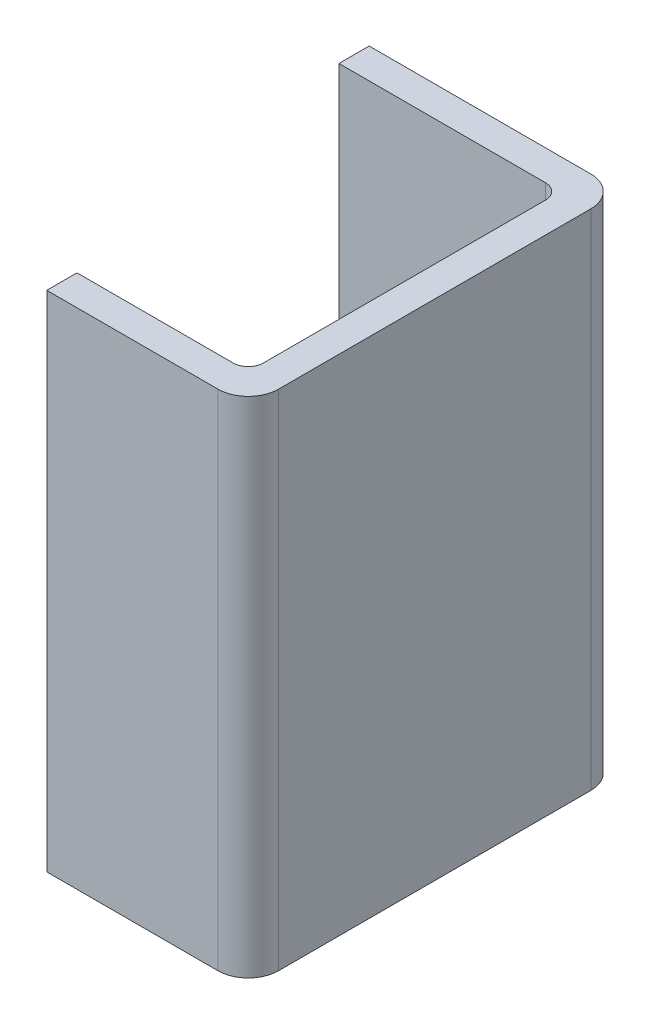
ISO-10303-21;
HEADER;
FILE_DESCRIPTION(('STEP AP214'),'2;1');
FILE_NAME('part.step','',(''),(''),'','','');
FILE_SCHEMA(('AUTOMOTIVE_DESIGN { 1 0 10303 214 1 1 1 1 }'));
ENDSEC;
DATA;
#1=APPLICATION_CONTEXT('core data for automotive mechanical design processes');
#2=APPLICATION_PROTOCOL_DEFINITION('international standard','automotive_design',2000,#1);
#3=PRODUCT_CONTEXT('',#1,'mechanical');
#4=PRODUCT('Part','Part','',(#3));
#5=PRODUCT_RELATED_PRODUCT_CATEGORY('part','',(#4));
#6=PRODUCT_DEFINITION_FORMATION('','',#4);
#7=PRODUCT_DEFINITION_CONTEXT('part definition',#1,'design');
#8=PRODUCT_DEFINITION('design','',#6,#7);
#9=PRODUCT_DEFINITION_SHAPE('','',#8);
#10=(LENGTH_UNIT() NAMED_UNIT(*) SI_UNIT(.MILLI.,.METRE.));
#11=(NAMED_UNIT(*) PLANE_ANGLE_UNIT() SI_UNIT($,.RADIAN.));
#12=(NAMED_UNIT(*) SI_UNIT($,.STERADIAN.) SOLID_ANGLE_UNIT());
#13=UNCERTAINTY_MEASURE_WITH_UNIT(LENGTH_MEASURE(1.E-05),#10,'distance_accuracy_value','');
#14=(GEOMETRIC_REPRESENTATION_CONTEXT(3) GLOBAL_UNCERTAINTY_ASSIGNED_CONTEXT((#13)) GLOBAL_UNIT_ASSIGNED_CONTEXT((#10,
#11,#12)) REPRESENTATION_CONTEXT('',''));
#15=CARTESIAN_POINT('',(0.,0.,0.));
#16=DIRECTION('',(0.,0.,1.));
#17=DIRECTION('',(1.,0.,0.));
#18=AXIS2_PLACEMENT_3D('',#15,#16,#17);
#19=CARTESIAN_POINT('',(0.375,-0.25,0.185));
#20=DIRECTION('',(0.,1.,0.));
#21=DIRECTION('',(0.,0.,1.));
#22=AXIS2_PLACEMENT_3D('',#19,#20,#21);
#23=PLANE('',#22);
#24=CARTESIAN_POINT('',(0.455,-0.25,0.0449999999999999));
#25=DIRECTION('',(0.,1.,0.));
#26=DIRECTION('',(-1.,0.,0.));
#27=AXIS2_PLACEMENT_3D('',#24,#25,#26);
#28=CIRCLE('',#27,0.015);
#29=CARTESIAN_POINT('',(0.47,-0.25,0.0449999999999999));
#30=VERTEX_POINT('',#29);
#31=CARTESIAN_POINT('',(0.455,-0.25,0.0299999999999999));
#32=VERTEX_POINT('',#31);
#33=EDGE_CURVE('E11',#30,#32,#28,.T.);
#34=ORIENTED_EDGE('',*,*,#33,.T.);
#35=DIRECTION('',(-1.,0.,0.));
#36=VECTOR('',#35,1.);
#37=CARTESIAN_POINT('',(-0.455000000000001,-0.25,0.03));
#38=LINE('',#37,#36);
#39=CARTESIAN_POINT('',(0.25,-0.25,0.0299999999999999));
#40=VERTEX_POINT('',#39);
#41=EDGE_CURVE('E24',#32,#40,#38,.T.);
#42=ORIENTED_EDGE('',*,*,#41,.T.);
#43=DIRECTION('',(0.,0.,-1.));
#44=VECTOR('',#43,1.);
#45=CARTESIAN_POINT('',(0.25,-0.25,-0.03));
#46=LINE('',#45,#44);
#47=CARTESIAN_POINT('',(0.25,-0.25,0.));
#48=VERTEX_POINT('',#47);
#49=EDGE_CURVE('E197',#40,#48,#46,.T.);
#50=ORIENTED_EDGE('',*,*,#49,.T.);
#51=DIRECTION('',(1.,0.,0.));
#52=VECTOR('',#51,1.);
#53=CARTESIAN_POINT('',(0.47,-0.25,0.));
#54=LINE('',#53,#52);
#55=CARTESIAN_POINT('',(0.47,-0.25,0.));
#56=VERTEX_POINT('',#55);
#57=EDGE_CURVE('E195',#48,#56,#54,.T.);
#58=ORIENTED_EDGE('',*,*,#57,.T.);
#59=CARTESIAN_POINT('',(0.47,-0.25,0.03));
#60=DIRECTION('',(0.,-1.,0.));
#61=DIRECTION('',(1.,0.,0.));
#62=AXIS2_PLACEMENT_3D('',#59,#60,#61);
#63=CIRCLE('',#62,0.03);
#64=CARTESIAN_POINT('',(0.5,-0.25,0.03));
#65=VERTEX_POINT('',#64);
#66=EDGE_CURVE('E193',#56,#65,#63,.T.);
#67=ORIENTED_EDGE('',*,*,#66,.T.);
#68=DIRECTION('',(0.,0.,1.));
#69=VECTOR('',#68,1.);
#70=CARTESIAN_POINT('',(0.5,-0.25,0.34));
#71=LINE('',#70,#69);
#72=CARTESIAN_POINT('',(0.5,-0.25,0.34));
#73=VERTEX_POINT('',#72);
#74=EDGE_CURVE('E191',#65,#73,#71,.T.);
#75=ORIENTED_EDGE('',*,*,#74,.T.);
#76=CARTESIAN_POINT('',(0.47,-0.25,0.34));
#77=DIRECTION('',(0.,-1.,0.));
#78=DIRECTION('',(0.,0.,1.));
#79=AXIS2_PLACEMENT_3D('',#76,#77,#78);
#80=CIRCLE('',#79,0.03);
#81=CARTESIAN_POINT('',(0.47,-0.25,0.37));
#82=VERTEX_POINT('',#81);
#83=EDGE_CURVE('E189',#73,#82,#80,.T.);
#84=ORIENTED_EDGE('',*,*,#83,.T.);
#85=DIRECTION('',(-1.,0.,0.));
#86=VECTOR('',#85,1.);
#87=CARTESIAN_POINT('',(-0.47,-0.25,0.37));
#88=LINE('',#87,#86);
#89=CARTESIAN_POINT('',(0.3,-0.25,0.37));
#90=VERTEX_POINT('',#89);
#91=EDGE_CURVE('E187',#82,#90,#88,.T.);
#92=ORIENTED_EDGE('',*,*,#91,.T.);
#93=DIRECTION('',(0.,0.,-1.));
#94=VECTOR('',#93,1.);
#95=CARTESIAN_POINT('',(0.3,-0.25,0.194187828264924));
#96=LINE('',#95,#94);
#97=CARTESIAN_POINT('',(0.3,-0.25,0.34));
#98=VERTEX_POINT('',#97);
#99=EDGE_CURVE('E185',#90,#98,#96,.T.);
#100=ORIENTED_EDGE('',*,*,#99,.T.);
#101=DIRECTION('',(1.,0.,0.));
#102=VECTOR('',#101,1.);
#103=CARTESIAN_POINT('',(0.455,-0.25,0.34));
#104=LINE('',#103,#102);
#105=CARTESIAN_POINT('',(0.455,-0.25,0.34));
#106=VERTEX_POINT('',#105);
#107=EDGE_CURVE('E183',#98,#106,#104,.T.);
#108=ORIENTED_EDGE('',*,*,#107,.T.);
#109=CARTESIAN_POINT('',(0.455,-0.25,0.325));
#110=DIRECTION('',(0.,1.,0.));
#111=DIRECTION('',(0.,0.,-1.));
#112=AXIS2_PLACEMENT_3D('',#109,#110,#111);
#113=CIRCLE('',#112,0.015);
#114=CARTESIAN_POINT('',(0.47,-0.25,0.325));
#115=VERTEX_POINT('',#114);
#116=EDGE_CURVE('E181',#106,#115,#113,.T.);
#117=ORIENTED_EDGE('',*,*,#116,.T.);
#118=DIRECTION('',(0.,0.,-1.));
#119=VECTOR('',#118,1.);
#120=CARTESIAN_POINT('',(0.47,-0.25,0.0449999999999999));
#121=LINE('',#120,#119);
#122=EDGE_CURVE('E179',#115,#30,#121,.T.);
#123=ORIENTED_EDGE('',*,*,#122,.T.);
#124=EDGE_LOOP('',(#34,#42,#50,#58,#67,#75,#84,#92,#100,#108,#117,#123));
#125=FACE_BOUND('',#124,.T.);
#126=ADVANCED_FACE('F17',(#125),#23,.F.);
#127=CARTESIAN_POINT('',(0.25,0.,0.0299999999999999));
#128=DIRECTION('',(0.,0.,1.));
#129=DIRECTION('',(1.,0.,0.));
#130=AXIS2_PLACEMENT_3D('',#127,#128,#129);
#131=PLANE('',#130);
#132=DIRECTION('',(0.,-1.,0.));
#133=VECTOR('',#132,1.);
#134=CARTESIAN_POINT('',(0.455,0.,0.0299999999999999));
#135=LINE('',#134,#133);
#136=CARTESIAN_POINT('',(0.455,0.25,0.0299999999999999));
#137=VERTEX_POINT('',#136);
#138=EDGE_CURVE('E177',#137,#32,#135,.T.);
#139=ORIENTED_EDGE('',*,*,#138,.F.);
#140=DIRECTION('',(1.,0.,0.));
#141=VECTOR('',#140,1.);
#142=CARTESIAN_POINT('',(-0.455000000000001,0.25,0.03));
#143=LINE('',#142,#141);
#144=CARTESIAN_POINT('',(0.25,0.25,0.0299999999999999));
#145=VERTEX_POINT('',#144);
#146=EDGE_CURVE('E120',#145,#137,#143,.T.);
#147=ORIENTED_EDGE('',*,*,#146,.F.);
#148=DIRECTION('',(0.,1.,0.));
#149=VECTOR('',#148,1.);
#150=CARTESIAN_POINT('',(0.25,0.,0.0299999999999999));
#151=LINE('',#150,#149);
#152=EDGE_CURVE('E173',#40,#145,#151,.T.);
#153=ORIENTED_EDGE('',*,*,#152,.F.);
#154=ORIENTED_EDGE('',*,*,#41,.F.);
#155=EDGE_LOOP('',(#139,#147,#153,#154));
#156=FACE_BOUND('',#155,.T.);
#157=ADVANCED_FACE('F205',(#156),#131,.T.);
#158=CARTESIAN_POINT('',(0.25,0.,0.));
#159=DIRECTION('',(-1.,0.,0.));
#160=DIRECTION('',(0.,0.,1.));
#161=AXIS2_PLACEMENT_3D('',#158,#159,#160);
#162=PLANE('',#161);
#163=ORIENTED_EDGE('',*,*,#152,.T.);
#164=DIRECTION('',(0.,0.,1.));
#165=VECTOR('',#164,1.);
#166=CARTESIAN_POINT('',(0.25,0.25,-0.03));
#167=LINE('',#166,#165);
#168=CARTESIAN_POINT('',(0.25,0.25,0.));
#169=VERTEX_POINT('',#168);
#170=EDGE_CURVE('E171',#169,#145,#167,.T.);
#171=ORIENTED_EDGE('',*,*,#170,.F.);
#172=DIRECTION('',(0.,1.,0.));
#173=VECTOR('',#172,1.);
#174=CARTESIAN_POINT('',(0.25,0.,0.));
#175=LINE('',#174,#173);
#176=EDGE_CURVE('E168',#48,#169,#175,.T.);
#177=ORIENTED_EDGE('',*,*,#176,.F.);
#178=ORIENTED_EDGE('',*,*,#49,.F.);
#179=EDGE_LOOP('',(#163,#171,#177,#178));
#180=FACE_BOUND('',#179,.T.);
#181=ADVANCED_FACE('F204',(#180),#162,.T.);
#182=CARTESIAN_POINT('',(0.47,0.,0.));
#183=DIRECTION('',(0.,0.,-1.));
#184=DIRECTION('',(-1.,0.,0.));
#185=AXIS2_PLACEMENT_3D('',#182,#183,#184);
#186=PLANE('',#185);
#187=ORIENTED_EDGE('',*,*,#176,.T.);
#188=DIRECTION('',(-1.,0.,0.));
#189=VECTOR('',#188,1.);
#190=CARTESIAN_POINT('',(0.47,0.25,0.));
#191=LINE('',#190,#189);
#192=CARTESIAN_POINT('',(0.47,0.25,0.));
#193=VERTEX_POINT('',#192);
#194=EDGE_CURVE('E165',#193,#169,#191,.T.);
#195=ORIENTED_EDGE('',*,*,#194,.F.);
#196=DIRECTION('',(0.,1.,0.));
#197=VECTOR('',#196,1.);
#198=CARTESIAN_POINT('',(0.47,0.,0.));
#199=LINE('',#198,#197);
#200=EDGE_CURVE('E162',#56,#193,#199,.T.);
#201=ORIENTED_EDGE('',*,*,#200,.F.);
#202=ORIENTED_EDGE('',*,*,#57,.F.);
#203=EDGE_LOOP('',(#187,#195,#201,#202));
#204=FACE_BOUND('',#203,.T.);
#205=ADVANCED_FACE('F212',(#204),#186,.T.);
#206=CARTESIAN_POINT('',(0.47,0.,0.03));
#207=DIRECTION('',(0.,1.,0.));
#208=DIRECTION('',(1.,0.,0.));
#209=AXIS2_PLACEMENT_3D('',#206,#207,#208);
#210=CYLINDRICAL_SURFACE('',#209,0.03);
#211=ORIENTED_EDGE('',*,*,#200,.T.);
#212=CARTESIAN_POINT('',(0.47,0.25,0.03));
#213=DIRECTION('',(0.,1.,0.));
#214=DIRECTION('',(1.,0.,0.));
#215=AXIS2_PLACEMENT_3D('',#212,#213,#214);
#216=CIRCLE('',#215,0.03);
#217=CARTESIAN_POINT('',(0.5,0.25,0.03));
#218=VERTEX_POINT('',#217);
#219=EDGE_CURVE('E159',#218,#193,#216,.T.);
#220=ORIENTED_EDGE('',*,*,#219,.F.);
#221=DIRECTION('',(0.,1.,0.));
#222=VECTOR('',#221,1.);
#223=CARTESIAN_POINT('',(0.5,0.,0.03));
#224=LINE('',#223,#222);
#225=EDGE_CURVE('E156',#65,#218,#224,.T.);
#226=ORIENTED_EDGE('',*,*,#225,.F.);
#227=ORIENTED_EDGE('',*,*,#66,.F.);
#228=EDGE_LOOP('',(#211,#220,#226,#227));
#229=FACE_BOUND('',#228,.T.);
#230=ADVANCED_FACE('F217',(#229),#210,.T.);
#231=CARTESIAN_POINT('',(0.5,0.,0.34));
#232=DIRECTION('',(1.,0.,0.));
#233=DIRECTION('',(0.,0.,-1.));
#234=AXIS2_PLACEMENT_3D('',#231,#232,#233);
#235=PLANE('',#234);
#236=ORIENTED_EDGE('',*,*,#225,.T.);
#237=DIRECTION('',(0.,0.,-1.));
#238=VECTOR('',#237,1.);
#239=CARTESIAN_POINT('',(0.5,0.25,0.34));
#240=LINE('',#239,#238);
#241=CARTESIAN_POINT('',(0.5,0.25,0.34));
#242=VERTEX_POINT('',#241);
#243=EDGE_CURVE('E153',#242,#218,#240,.T.);
#244=ORIENTED_EDGE('',*,*,#243,.F.);
#245=DIRECTION('',(0.,1.,0.));
#246=VECTOR('',#245,1.);
#247=CARTESIAN_POINT('',(0.5,0.,0.34));
#248=LINE('',#247,#246);
#249=EDGE_CURVE('E150',#73,#242,#248,.T.);
#250=ORIENTED_EDGE('',*,*,#249,.F.);
#251=ORIENTED_EDGE('',*,*,#74,.F.);
#252=EDGE_LOOP('',(#236,#244,#250,#251));
#253=FACE_BOUND('',#252,.T.);
#254=ADVANCED_FACE('F221',(#253),#235,.T.);
#255=CARTESIAN_POINT('',(0.47,0.,0.34));
#256=DIRECTION('',(0.,1.,0.));
#257=DIRECTION('',(0.,0.,1.));
#258=AXIS2_PLACEMENT_3D('',#255,#256,#257);
#259=CYLINDRICAL_SURFACE('',#258,0.03);
#260=ORIENTED_EDGE('',*,*,#249,.T.);
#261=CARTESIAN_POINT('',(0.47,0.25,0.34));
#262=DIRECTION('',(0.,1.,0.));
#263=DIRECTION('',(0.,0.,1.));
#264=AXIS2_PLACEMENT_3D('',#261,#262,#263);
#265=CIRCLE('',#264,0.03);
#266=CARTESIAN_POINT('',(0.47,0.25,0.37));
#267=VERTEX_POINT('',#266);
#268=EDGE_CURVE('E147',#267,#242,#265,.T.);
#269=ORIENTED_EDGE('',*,*,#268,.F.);
#270=DIRECTION('',(0.,1.,0.));
#271=VECTOR('',#270,1.);
#272=CARTESIAN_POINT('',(0.47,0.,0.37));
#273=LINE('',#272,#271);
#274=EDGE_CURVE('E144',#82,#267,#273,.T.);
#275=ORIENTED_EDGE('',*,*,#274,.F.);
#276=ORIENTED_EDGE('',*,*,#83,.F.);
#277=EDGE_LOOP('',(#260,#269,#275,#276));
#278=FACE_BOUND('',#277,.T.);
#279=ADVANCED_FACE('F225',(#278),#259,.T.);
#280=CARTESIAN_POINT('',(0.3,0.,0.37));
#281=DIRECTION('',(0.,0.,1.));
#282=DIRECTION('',(1.,0.,0.));
#283=AXIS2_PLACEMENT_3D('',#280,#281,#282);
#284=PLANE('',#283);
#285=ORIENTED_EDGE('',*,*,#274,.T.);
#286=DIRECTION('',(1.,0.,0.));
#287=VECTOR('',#286,1.);
#288=CARTESIAN_POINT('',(-0.47,0.25,0.37));
#289=LINE('',#288,#287);
#290=CARTESIAN_POINT('',(0.3,0.25,0.37));
#291=VERTEX_POINT('',#290);
#292=EDGE_CURVE('E141',#291,#267,#289,.T.);
#293=ORIENTED_EDGE('',*,*,#292,.F.);
#294=DIRECTION('',(0.,1.,0.));
#295=VECTOR('',#294,1.);
#296=CARTESIAN_POINT('',(0.3,0.,0.37));
#297=LINE('',#296,#295);
#298=EDGE_CURVE('E138',#90,#291,#297,.T.);
#299=ORIENTED_EDGE('',*,*,#298,.F.);
#300=ORIENTED_EDGE('',*,*,#91,.F.);
#301=EDGE_LOOP('',(#285,#293,#299,#300));
#302=FACE_BOUND('',#301,.T.);
#303=ADVANCED_FACE('F229',(#302),#284,.T.);
#304=CARTESIAN_POINT('',(0.3,0.,0.34));
#305=DIRECTION('',(-1.,0.,0.));
#306=DIRECTION('',(0.,0.,1.));
#307=AXIS2_PLACEMENT_3D('',#304,#305,#306);
#308=PLANE('',#307);
#309=ORIENTED_EDGE('',*,*,#298,.T.);
#310=DIRECTION('',(0.,0.,1.));
#311=VECTOR('',#310,1.);
#312=CARTESIAN_POINT('',(0.3,0.25,0.194187828264924));
#313=LINE('',#312,#311);
#314=CARTESIAN_POINT('',(0.3,0.25,0.34));
#315=VERTEX_POINT('',#314);
#316=EDGE_CURVE('E135',#315,#291,#313,.T.);
#317=ORIENTED_EDGE('',*,*,#316,.F.);
#318=DIRECTION('',(0.,1.,0.));
#319=VECTOR('',#318,1.);
#320=CARTESIAN_POINT('',(0.3,0.,0.34));
#321=LINE('',#320,#319);
#322=EDGE_CURVE('E132',#98,#315,#321,.T.);
#323=ORIENTED_EDGE('',*,*,#322,.F.);
#324=ORIENTED_EDGE('',*,*,#99,.F.);
#325=EDGE_LOOP('',(#309,#317,#323,#324));
#326=FACE_BOUND('',#325,.T.);
#327=ADVANCED_FACE('F233',(#326),#308,.T.);
#328=CARTESIAN_POINT('',(0.455,0.,0.34));
#329=DIRECTION('',(0.,0.,-1.));
#330=DIRECTION('',(-1.,0.,0.));
#331=AXIS2_PLACEMENT_3D('',#328,#329,#330);
#332=PLANE('',#331);
#333=ORIENTED_EDGE('',*,*,#322,.T.);
#334=DIRECTION('',(-1.,0.,0.));
#335=VECTOR('',#334,1.);
#336=CARTESIAN_POINT('',(0.455,0.25,0.34));
#337=LINE('',#336,#335);
#338=CARTESIAN_POINT('',(0.455,0.25,0.34));
#339=VERTEX_POINT('',#338);
#340=EDGE_CURVE('E129',#339,#315,#337,.T.);
#341=ORIENTED_EDGE('',*,*,#340,.F.);
#342=DIRECTION('',(0.,1.,0.));
#343=VECTOR('',#342,1.);
#344=CARTESIAN_POINT('',(0.455,0.,0.34));
#345=LINE('',#344,#343);
#346=EDGE_CURVE('E126',#106,#339,#345,.T.);
#347=ORIENTED_EDGE('',*,*,#346,.F.);
#348=ORIENTED_EDGE('',*,*,#107,.F.);
#349=EDGE_LOOP('',(#333,#341,#347,#348));
#350=FACE_BOUND('',#349,.T.);
#351=ADVANCED_FACE('F237',(#350),#332,.T.);
#352=CARTESIAN_POINT('',(0.455,0.,0.325));
#353=DIRECTION('',(0.,1.,0.));
#354=DIRECTION('',(0.,0.,-1.));
#355=AXIS2_PLACEMENT_3D('',#352,#353,#354);
#356=CYLINDRICAL_SURFACE('',#355,0.015);
#357=ORIENTED_EDGE('',*,*,#346,.T.);
#358=CARTESIAN_POINT('',(0.455,0.25,0.325));
#359=DIRECTION('',(0.,-1.,0.));
#360=DIRECTION('',(0.,0.,-1.));
#361=AXIS2_PLACEMENT_3D('',#358,#359,#360);
#362=CIRCLE('',#361,0.015);
#363=CARTESIAN_POINT('',(0.47,0.25,0.325));
#364=VERTEX_POINT('',#363);
#365=EDGE_CURVE('E124',#364,#339,#362,.T.);
#366=ORIENTED_EDGE('',*,*,#365,.F.);
#367=DIRECTION('',(0.,1.,0.));
#368=VECTOR('',#367,1.);
#369=CARTESIAN_POINT('',(0.47,0.,0.325));
#370=LINE('',#369,#368);
#371=EDGE_CURVE('E107',#115,#364,#370,.T.);
#372=ORIENTED_EDGE('',*,*,#371,.F.);
#373=ORIENTED_EDGE('',*,*,#116,.F.);
#374=EDGE_LOOP('',(#357,#366,#372,#373));
#375=FACE_BOUND('',#374,.T.);
#376=ADVANCED_FACE('F241',(#375),#356,.F.);
#377=CARTESIAN_POINT('',(0.47,0.,0.0449999999999999));
#378=DIRECTION('',(-1.,0.,0.));
#379=DIRECTION('',(0.,0.,1.));
#380=AXIS2_PLACEMENT_3D('',#377,#378,#379);
#381=PLANE('',#380);
#382=ORIENTED_EDGE('',*,*,#371,.T.);
#383=DIRECTION('',(0.,0.,1.));
#384=VECTOR('',#383,1.);
#385=CARTESIAN_POINT('',(0.47,0.25,0.0449999999999999));
#386=LINE('',#385,#384);
#387=CARTESIAN_POINT('',(0.47,0.25,0.0449999999999999));
#388=VERTEX_POINT('',#387);
#389=EDGE_CURVE('E102',#388,#364,#386,.T.);
#390=ORIENTED_EDGE('',*,*,#389,.F.);
#391=DIRECTION('',(0.,1.,0.));
#392=VECTOR('',#391,1.);
#393=CARTESIAN_POINT('',(0.47,0.,0.0449999999999999));
#394=LINE('',#393,#392);
#395=EDGE_CURVE('E105',#30,#388,#394,.T.);
#396=ORIENTED_EDGE('',*,*,#395,.F.);
#397=ORIENTED_EDGE('',*,*,#122,.F.);
#398=EDGE_LOOP('',(#382,#390,#396,#397));
#399=FACE_BOUND('',#398,.T.);
#400=ADVANCED_FACE('F103',(#399),#381,.T.);
#401=CARTESIAN_POINT('',(0.455,0.,0.0449999999999999));
#402=DIRECTION('',(0.,1.,0.));
#403=DIRECTION('',(-1.,0.,0.));
#404=AXIS2_PLACEMENT_3D('',#401,#402,#403);
#405=CYLINDRICAL_SURFACE('',#404,0.015);
#406=ORIENTED_EDGE('',*,*,#395,.T.);
#407=CARTESIAN_POINT('',(0.455,0.25,0.0449999999999999));
#408=DIRECTION('',(0.,-1.,0.));
#409=DIRECTION('',(-1.,0.,0.));
#410=AXIS2_PLACEMENT_3D('',#407,#408,#409);
#411=CIRCLE('',#410,0.015);
#412=EDGE_CURVE('E115',#137,#388,#411,.T.);
#413=ORIENTED_EDGE('',*,*,#412,.F.);
#414=ORIENTED_EDGE('',*,*,#138,.T.);
#415=ORIENTED_EDGE('',*,*,#33,.F.);
#416=EDGE_LOOP('',(#406,#413,#414,#415));
#417=FACE_BOUND('',#416,.T.);
#418=ADVANCED_FACE('F114',(#417),#405,.F.);
#419=CARTESIAN_POINT('',(0.375,0.25,0.185));
#420=DIRECTION('',(0.,1.,0.));
#421=DIRECTION('',(0.,0.,1.));
#422=AXIS2_PLACEMENT_3D('',#419,#420,#421);
#423=PLANE('',#422);
#424=ORIENTED_EDGE('',*,*,#412,.T.);
#425=ORIENTED_EDGE('',*,*,#389,.T.);
#426=ORIENTED_EDGE('',*,*,#365,.T.);
#427=ORIENTED_EDGE('',*,*,#340,.T.);
#428=ORIENTED_EDGE('',*,*,#316,.T.);
#429=ORIENTED_EDGE('',*,*,#292,.T.);
#430=ORIENTED_EDGE('',*,*,#268,.T.);
#431=ORIENTED_EDGE('',*,*,#243,.T.);
#432=ORIENTED_EDGE('',*,*,#219,.T.);
#433=ORIENTED_EDGE('',*,*,#194,.T.);
#434=ORIENTED_EDGE('',*,*,#170,.T.);
#435=ORIENTED_EDGE('',*,*,#146,.T.);
#436=EDGE_LOOP('',(#424,#425,#426,#427,#428,#429,#430,#431,#432,#433,#434,#435));
#437=FACE_BOUND('',#436,.T.);
#438=ADVANCED_FACE('F118',(#437),#423,.T.);
#439=CLOSED_SHELL('',(#126,#157,#181,#205,#230,#254,#279,#303,#327,#351,#376,#400,#418,#438));
#440=MANIFOLD_SOLID_BREP('B1',#439);
#441=ADVANCED_BREP_SHAPE_REPRESENTATION('',(#18,#440),#14);
#442=SHAPE_DEFINITION_REPRESENTATION(#9,#441);
ENDSEC;
END-ISO-10303-21;
